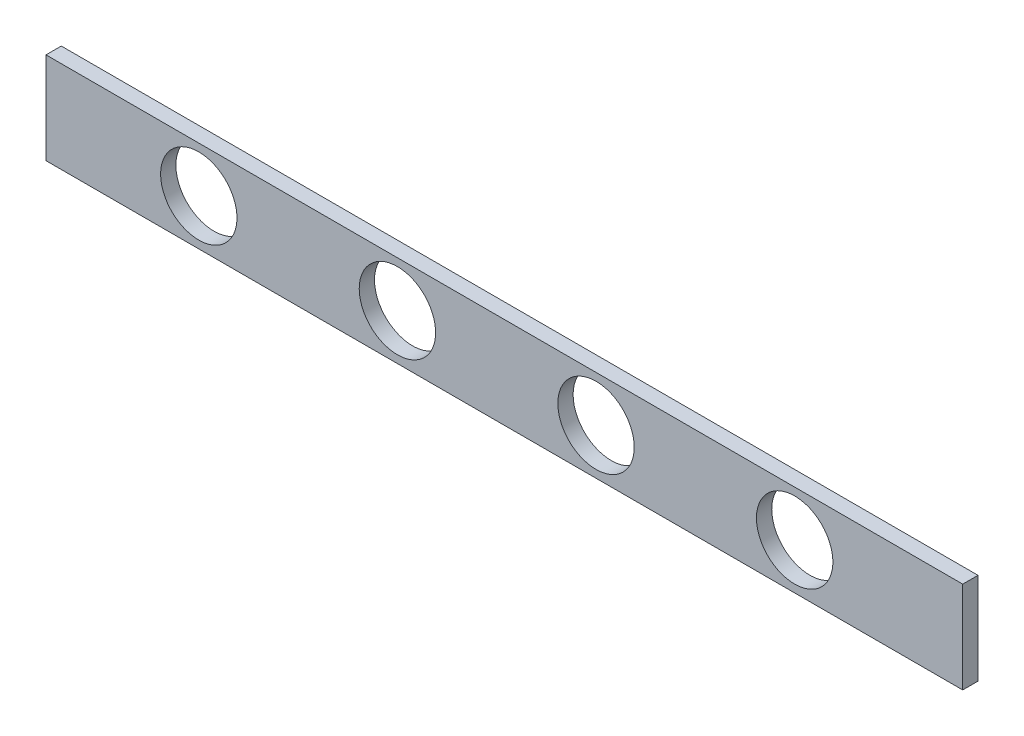
ISO-10303-21;
HEADER;
FILE_DESCRIPTION(('STEP AP214'),'2;1');
FILE_NAME('part.step','',(''),(''),'','','');
FILE_SCHEMA(('AUTOMOTIVE_DESIGN { 1 0 10303 214 1 1 1 1 }'));
ENDSEC;
DATA;
#1=APPLICATION_CONTEXT('core data for automotive mechanical design processes');
#2=APPLICATION_PROTOCOL_DEFINITION('international standard','automotive_design',2000,#1);
#3=PRODUCT_CONTEXT('',#1,'mechanical');
#4=PRODUCT('Part','Part','',(#3));
#5=PRODUCT_RELATED_PRODUCT_CATEGORY('part','',(#4));
#6=PRODUCT_DEFINITION_FORMATION('','',#4);
#7=PRODUCT_DEFINITION_CONTEXT('part definition',#1,'design');
#8=PRODUCT_DEFINITION('design','',#6,#7);
#9=PRODUCT_DEFINITION_SHAPE('','',#8);
#10=(LENGTH_UNIT() NAMED_UNIT(*) SI_UNIT(.MILLI.,.METRE.));
#11=(NAMED_UNIT(*) PLANE_ANGLE_UNIT() SI_UNIT($,.RADIAN.));
#12=(NAMED_UNIT(*) SI_UNIT($,.STERADIAN.) SOLID_ANGLE_UNIT());
#13=UNCERTAINTY_MEASURE_WITH_UNIT(LENGTH_MEASURE(1.E-05),#10,'distance_accuracy_value','');
#14=(GEOMETRIC_REPRESENTATION_CONTEXT(3) GLOBAL_UNCERTAINTY_ASSIGNED_CONTEXT((#13)) GLOBAL_UNIT_ASSIGNED_CONTEXT((#10,
#11,#12)) REPRESENTATION_CONTEXT('',''));
#15=CARTESIAN_POINT('',(0.,0.,0.));
#16=DIRECTION('',(0.,0.,1.));
#17=DIRECTION('',(1.,0.,0.));
#18=AXIS2_PLACEMENT_3D('',#15,#16,#17);
#19=CARTESIAN_POINT('',(0.,0.,5.));
#20=DIRECTION('',(1.,0.,0.));
#21=DIRECTION('',(0.,0.,-1.));
#22=AXIS2_PLACEMENT_3D('',#19,#20,#21);
#23=PLANE('',#22);
#24=DIRECTION('',(0.,-1.,0.));
#25=VECTOR('',#24,1.);
#26=CARTESIAN_POINT('',(0.,0.,0.));
#27=LINE('',#26,#25);
#28=CARTESIAN_POINT('',(0.,30.,0.));
#29=VERTEX_POINT('',#28);
#30=CARTESIAN_POINT('',(0.,0.,0.));
#31=VERTEX_POINT('',#30);
#32=EDGE_CURVE('E99',#29,#31,#27,.T.);
#33=ORIENTED_EDGE('',*,*,#32,.T.);
#34=DIRECTION('',(0.,0.,-1.));
#35=VECTOR('',#34,1.);
#36=CARTESIAN_POINT('',(0.,0.,5.));
#37=LINE('',#36,#35);
#38=CARTESIAN_POINT('',(0.,0.,5.));
#39=VERTEX_POINT('',#38);
#40=EDGE_CURVE('E11',#39,#31,#37,.T.);
#41=ORIENTED_EDGE('',*,*,#40,.F.);
#42=DIRECTION('',(0.,-1.,0.));
#43=VECTOR('',#42,1.);
#44=CARTESIAN_POINT('',(0.,0.,5.));
#45=LINE('',#44,#43);
#46=CARTESIAN_POINT('',(0.,30.,5.));
#47=VERTEX_POINT('',#46);
#48=EDGE_CURVE('E87',#47,#39,#45,.T.);
#49=ORIENTED_EDGE('',*,*,#48,.F.);
#50=DIRECTION('',(0.,0.,-1.));
#51=VECTOR('',#50,1.);
#52=CARTESIAN_POINT('',(0.,30.,5.));
#53=LINE('',#52,#51);
#54=EDGE_CURVE('E95',#47,#29,#53,.T.);
#55=ORIENTED_EDGE('',*,*,#54,.T.);
#56=EDGE_LOOP('',(#33,#41,#49,#55));
#57=FACE_BOUND('',#56,.T.);
#58=ADVANCED_FACE('F36',(#57),#23,.F.);
#59=CARTESIAN_POINT('',(0.,0.,5.));
#60=DIRECTION('',(0.,1.,0.));
#61=DIRECTION('',(0.,0.,1.));
#62=AXIS2_PLACEMENT_3D('',#59,#60,#61);
#63=PLANE('',#62);
#64=DIRECTION('',(1.,0.,0.));
#65=VECTOR('',#64,1.);
#66=CARTESIAN_POINT('',(0.,0.,0.));
#67=LINE('',#66,#65);
#68=CARTESIAN_POINT('',(300.,0.,0.));
#69=VERTEX_POINT('',#68);
#70=EDGE_CURVE('E91',#31,#69,#67,.T.);
#71=ORIENTED_EDGE('',*,*,#70,.T.);
#72=DIRECTION('',(0.,0.,-1.));
#73=VECTOR('',#72,1.);
#74=CARTESIAN_POINT('',(300.,0.,5.));
#75=LINE('',#74,#73);
#76=CARTESIAN_POINT('',(300.,0.,5.));
#77=VERTEX_POINT('',#76);
#78=EDGE_CURVE('E44',#77,#69,#75,.T.);
#79=ORIENTED_EDGE('',*,*,#78,.F.);
#80=DIRECTION('',(1.,0.,0.));
#81=VECTOR('',#80,1.);
#82=CARTESIAN_POINT('',(0.,0.,5.));
#83=LINE('',#82,#81);
#84=EDGE_CURVE('E82',#39,#77,#83,.T.);
#85=ORIENTED_EDGE('',*,*,#84,.F.);
#86=ORIENTED_EDGE('',*,*,#40,.T.);
#87=EDGE_LOOP('',(#71,#79,#85,#86));
#88=FACE_BOUND('',#87,.T.);
#89=ADVANCED_FACE('F90',(#88),#63,.F.);
#90=CARTESIAN_POINT('',(300.,0.,5.));
#91=DIRECTION('',(-1.,0.,0.));
#92=DIRECTION('',(0.,0.,1.));
#93=AXIS2_PLACEMENT_3D('',#90,#91,#92);
#94=PLANE('',#93);
#95=DIRECTION('',(0.,1.,0.));
#96=VECTOR('',#95,1.);
#97=CARTESIAN_POINT('',(300.,0.,0.));
#98=LINE('',#97,#96);
#99=CARTESIAN_POINT('',(300.,30.,0.));
#100=VERTEX_POINT('',#99);
#101=EDGE_CURVE('E69',#69,#100,#98,.T.);
#102=ORIENTED_EDGE('',*,*,#101,.T.);
#103=DIRECTION('',(0.,0.,-1.));
#104=VECTOR('',#103,1.);
#105=CARTESIAN_POINT('',(300.,30.,5.));
#106=LINE('',#105,#104);
#107=CARTESIAN_POINT('',(300.,30.,5.));
#108=VERTEX_POINT('',#107);
#109=EDGE_CURVE('E92',#108,#100,#106,.T.);
#110=ORIENTED_EDGE('',*,*,#109,.F.);
#111=DIRECTION('',(0.,1.,0.));
#112=VECTOR('',#111,1.);
#113=CARTESIAN_POINT('',(300.,0.,5.));
#114=LINE('',#113,#112);
#115=EDGE_CURVE('E85',#77,#108,#114,.T.);
#116=ORIENTED_EDGE('',*,*,#115,.F.);
#117=ORIENTED_EDGE('',*,*,#78,.T.);
#118=EDGE_LOOP('',(#102,#110,#116,#117));
#119=FACE_BOUND('',#118,.T.);
#120=ADVANCED_FACE('F93',(#119),#94,.F.);
#121=CARTESIAN_POINT('',(0.,30.,5.));
#122=DIRECTION('',(0.,-1.,0.));
#123=DIRECTION('',(0.,0.,-1.));
#124=AXIS2_PLACEMENT_3D('',#121,#122,#123);
#125=PLANE('',#124);
#126=DIRECTION('',(-1.,0.,0.));
#127=VECTOR('',#126,1.);
#128=CARTESIAN_POINT('',(0.,30.,0.));
#129=LINE('',#128,#127);
#130=EDGE_CURVE('E75',#100,#29,#129,.T.);
#131=ORIENTED_EDGE('',*,*,#130,.T.);
#132=ORIENTED_EDGE('',*,*,#54,.F.);
#133=DIRECTION('',(-1.,0.,0.));
#134=VECTOR('',#133,1.);
#135=CARTESIAN_POINT('',(0.,30.,5.));
#136=LINE('',#135,#134);
#137=EDGE_CURVE('E52',#108,#47,#136,.T.);
#138=ORIENTED_EDGE('',*,*,#137,.F.);
#139=ORIENTED_EDGE('',*,*,#109,.T.);
#140=EDGE_LOOP('',(#131,#132,#138,#139));
#141=FACE_BOUND('',#140,.T.);
#142=ADVANCED_FACE('F107',(#141),#125,.F.);
#143=CARTESIAN_POINT('',(0.,0.,5.));
#144=DIRECTION('',(0.,0.,-1.));
#145=DIRECTION('',(-1.,0.,0.));
#146=AXIS2_PLACEMENT_3D('',#143,#144,#145);
#147=PLANE('',#146);
#148=CARTESIAN_POINT('',(115.,14.9999999999995,5.));
#149=DIRECTION('',(0.,0.,-1.));
#150=DIRECTION('',(-1.,0.,0.));
#151=AXIS2_PLACEMENT_3D('',#148,#149,#150);
#152=CIRCLE('',#151,12.5);
#153=CARTESIAN_POINT('',(102.5,14.9999999999995,5.));
#154=VERTEX_POINT('',#153);
#155=EDGE_CURVE('E116',#154,#154,#152,.T.);
#156=ORIENTED_EDGE('',*,*,#155,.T.);
#157=EDGE_LOOP('',(#156));
#158=FACE_BOUND('',#157,.T.);
#159=CARTESIAN_POINT('',(180.,14.9999999999991,5.));
#160=DIRECTION('',(0.,0.,-1.));
#161=DIRECTION('',(-1.,0.,0.));
#162=AXIS2_PLACEMENT_3D('',#159,#160,#161);
#163=CIRCLE('',#162,12.5);
#164=CARTESIAN_POINT('',(167.5,14.9999999999991,5.));
#165=VERTEX_POINT('',#164);
#166=EDGE_CURVE('E128',#165,#165,#163,.T.);
#167=ORIENTED_EDGE('',*,*,#166,.T.);
#168=EDGE_LOOP('',(#167));
#169=FACE_BOUND('',#168,.T.);
#170=CARTESIAN_POINT('',(245.,14.9999999999986,5.));
#171=DIRECTION('',(0.,0.,-1.));
#172=DIRECTION('',(-1.,0.,0.));
#173=AXIS2_PLACEMENT_3D('',#170,#171,#172);
#174=CIRCLE('',#173,12.5);
#175=CARTESIAN_POINT('',(232.5,14.9999999999986,5.));
#176=VERTEX_POINT('',#175);
#177=EDGE_CURVE('E122',#176,#176,#174,.T.);
#178=ORIENTED_EDGE('',*,*,#177,.T.);
#179=EDGE_LOOP('',(#178));
#180=FACE_BOUND('',#179,.T.);
#181=CARTESIAN_POINT('',(50.,15.,5.));
#182=DIRECTION('',(0.,0.,-1.));
#183=DIRECTION('',(-1.,0.,0.));
#184=AXIS2_PLACEMENT_3D('',#181,#182,#183);
#185=CIRCLE('',#184,12.5);
#186=CARTESIAN_POINT('',(37.5,15.,5.));
#187=VERTEX_POINT('',#186);
#188=EDGE_CURVE('E102',#187,#187,#185,.T.);
#189=ORIENTED_EDGE('',*,*,#188,.T.);
#190=EDGE_LOOP('',(#189));
#191=FACE_BOUND('',#190,.T.);
#192=ORIENTED_EDGE('',*,*,#48,.T.);
#193=ORIENTED_EDGE('',*,*,#84,.T.);
#194=ORIENTED_EDGE('',*,*,#115,.T.);
#195=ORIENTED_EDGE('',*,*,#137,.T.);
#196=EDGE_LOOP('',(#192,#193,#194,#195));
#197=FACE_BOUND('',#196,.T.);
#198=ADVANCED_FACE('F83',(#158,#169,#180,#191,#197),#147,.F.);
#199=CARTESIAN_POINT('',(0.,0.,0.));
#200=DIRECTION('',(0.,0.,-1.));
#201=DIRECTION('',(-1.,0.,0.));
#202=AXIS2_PLACEMENT_3D('',#199,#200,#201);
#203=PLANE('',#202);
#204=CARTESIAN_POINT('',(115.,14.9999999999995,0.));
#205=DIRECTION('',(0.,0.,-1.));
#206=DIRECTION('',(-1.,0.,0.));
#207=AXIS2_PLACEMENT_3D('',#204,#205,#206);
#208=CIRCLE('',#207,12.5);
#209=CARTESIAN_POINT('',(102.5,14.9999999999995,0.));
#210=VERTEX_POINT('',#209);
#211=EDGE_CURVE('E131',#210,#210,#208,.T.);
#212=ORIENTED_EDGE('',*,*,#211,.F.);
#213=EDGE_LOOP('',(#212));
#214=FACE_BOUND('',#213,.T.);
#215=CARTESIAN_POINT('',(180.,14.9999999999991,0.));
#216=DIRECTION('',(0.,0.,-1.));
#217=DIRECTION('',(-1.,0.,0.));
#218=AXIS2_PLACEMENT_3D('',#215,#216,#217);
#219=CIRCLE('',#218,12.5);
#220=CARTESIAN_POINT('',(167.5,14.9999999999991,0.));
#221=VERTEX_POINT('',#220);
#222=EDGE_CURVE('E125',#221,#221,#219,.T.);
#223=ORIENTED_EDGE('',*,*,#222,.F.);
#224=EDGE_LOOP('',(#223));
#225=FACE_BOUND('',#224,.T.);
#226=CARTESIAN_POINT('',(245.,14.9999999999986,0.));
#227=DIRECTION('',(0.,0.,-1.));
#228=DIRECTION('',(-1.,0.,0.));
#229=AXIS2_PLACEMENT_3D('',#226,#227,#228);
#230=CIRCLE('',#229,12.5);
#231=CARTESIAN_POINT('',(232.5,14.9999999999986,0.));
#232=VERTEX_POINT('',#231);
#233=EDGE_CURVE('E119',#232,#232,#230,.T.);
#234=ORIENTED_EDGE('',*,*,#233,.F.);
#235=EDGE_LOOP('',(#234));
#236=FACE_BOUND('',#235,.T.);
#237=CARTESIAN_POINT('',(50.,15.,0.));
#238=DIRECTION('',(0.,0.,-1.));
#239=DIRECTION('',(-1.,0.,0.));
#240=AXIS2_PLACEMENT_3D('',#237,#238,#239);
#241=CIRCLE('',#240,12.5);
#242=CARTESIAN_POINT('',(37.5,15.,0.));
#243=VERTEX_POINT('',#242);
#244=EDGE_CURVE('E113',#243,#243,#241,.T.);
#245=ORIENTED_EDGE('',*,*,#244,.F.);
#246=EDGE_LOOP('',(#245));
#247=FACE_BOUND('',#246,.T.);
#248=ORIENTED_EDGE('',*,*,#32,.F.);
#249=ORIENTED_EDGE('',*,*,#130,.F.);
#250=ORIENTED_EDGE('',*,*,#101,.F.);
#251=ORIENTED_EDGE('',*,*,#70,.F.);
#252=EDGE_LOOP('',(#248,#249,#250,#251));
#253=FACE_BOUND('',#252,.T.);
#254=ADVANCED_FACE('F110',(#214,#225,#236,#247,#253),#203,.T.);
#255=CARTESIAN_POINT('',(50.,15.,5.));
#256=DIRECTION('',(0.,0.,-1.));
#257=DIRECTION('',(-1.,0.,0.));
#258=AXIS2_PLACEMENT_3D('',#255,#256,#257);
#259=CYLINDRICAL_SURFACE('',#258,12.5);
#260=ORIENTED_EDGE('',*,*,#188,.F.);
#261=EDGE_LOOP('',(#260));
#262=FACE_BOUND('',#261,.T.);
#263=ORIENTED_EDGE('',*,*,#244,.T.);
#264=EDGE_LOOP('',(#263));
#265=FACE_BOUND('',#264,.T.);
#266=ADVANCED_FACE('F148',(#262,#265),#259,.F.);
#267=CARTESIAN_POINT('',(245.,14.9999999999986,5.));
#268=DIRECTION('',(0.,0.,-1.));
#269=DIRECTION('',(-1.,0.,0.));
#270=AXIS2_PLACEMENT_3D('',#267,#268,#269);
#271=CYLINDRICAL_SURFACE('',#270,12.5);
#272=ORIENTED_EDGE('',*,*,#177,.F.);
#273=EDGE_LOOP('',(#272));
#274=FACE_BOUND('',#273,.T.);
#275=ORIENTED_EDGE('',*,*,#233,.T.);
#276=EDGE_LOOP('',(#275));
#277=FACE_BOUND('',#276,.T.);
#278=ADVANCED_FACE('F157',(#274,#277),#271,.F.);
#279=CARTESIAN_POINT('',(180.,14.9999999999991,5.));
#280=DIRECTION('',(0.,0.,-1.));
#281=DIRECTION('',(-1.,0.,0.));
#282=AXIS2_PLACEMENT_3D('',#279,#280,#281);
#283=CYLINDRICAL_SURFACE('',#282,12.5);
#284=ORIENTED_EDGE('',*,*,#166,.F.);
#285=EDGE_LOOP('',(#284));
#286=FACE_BOUND('',#285,.T.);
#287=ORIENTED_EDGE('',*,*,#222,.T.);
#288=EDGE_LOOP('',(#287));
#289=FACE_BOUND('',#288,.T.);
#290=ADVANCED_FACE('F142',(#286,#289),#283,.F.);
#291=CARTESIAN_POINT('',(115.,14.9999999999995,5.));
#292=DIRECTION('',(0.,0.,-1.));
#293=DIRECTION('',(-1.,0.,0.));
#294=AXIS2_PLACEMENT_3D('',#291,#292,#293);
#295=CYLINDRICAL_SURFACE('',#294,12.5);
#296=ORIENTED_EDGE('',*,*,#155,.F.);
#297=EDGE_LOOP('',(#296));
#298=FACE_BOUND('',#297,.T.);
#299=ORIENTED_EDGE('',*,*,#211,.T.);
#300=EDGE_LOOP('',(#299));
#301=FACE_BOUND('',#300,.T.);
#302=ADVANCED_FACE('F139',(#298,#301),#295,.F.);
#303=CLOSED_SHELL('',(#58,#89,#120,#142,#198,#254,#266,#278,#290,#302));
#304=MANIFOLD_SOLID_BREP('B2',#303);
#305=ADVANCED_BREP_SHAPE_REPRESENTATION('',(#18,#304),#14);
#306=SHAPE_DEFINITION_REPRESENTATION(#9,#305);
ENDSEC;
END-ISO-10303-21;
